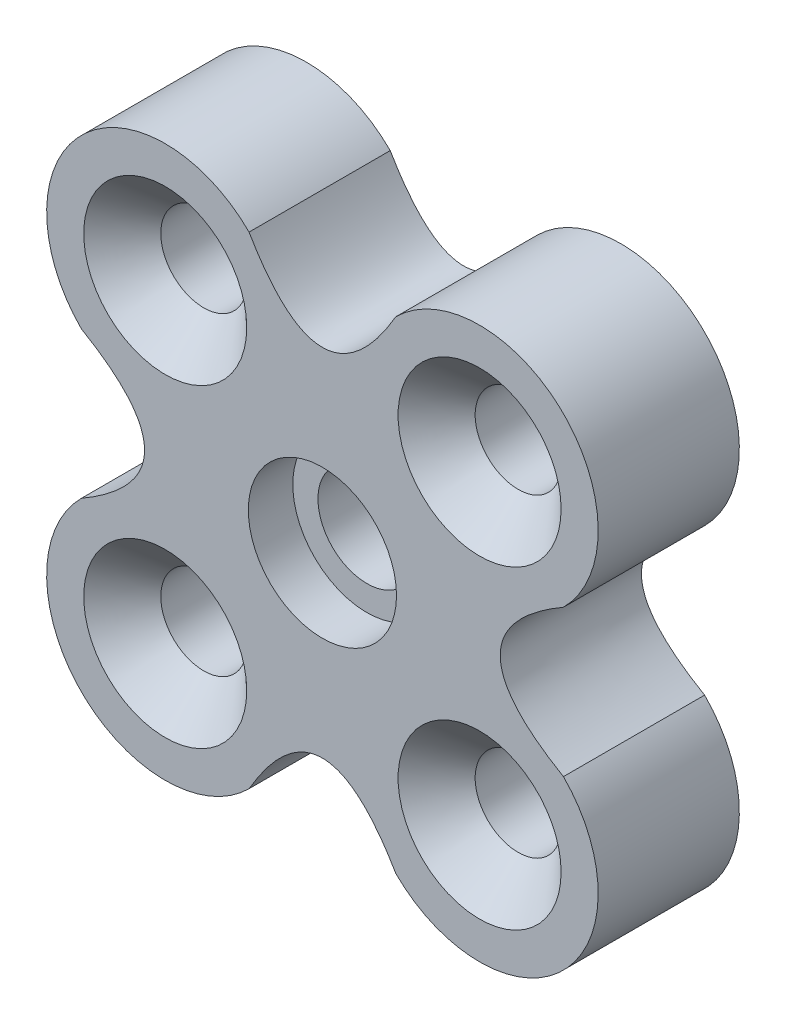
ISO-10303-21;
HEADER;
FILE_DESCRIPTION(('STEP AP214'),'2;1');
FILE_NAME('part.step','',(''),(''),'','','');
FILE_SCHEMA(('AUTOMOTIVE_DESIGN { 1 0 10303 214 1 1 1 1 }'));
ENDSEC;
DATA;
#1=APPLICATION_CONTEXT('core data for automotive mechanical design processes');
#2=APPLICATION_PROTOCOL_DEFINITION('international standard','automotive_design',2000,#1);
#3=PRODUCT_CONTEXT('',#1,'mechanical');
#4=PRODUCT('Part','Part','',(#3));
#5=PRODUCT_RELATED_PRODUCT_CATEGORY('part','',(#4));
#6=PRODUCT_DEFINITION_FORMATION('','',#4);
#7=PRODUCT_DEFINITION_CONTEXT('part definition',#1,'design');
#8=PRODUCT_DEFINITION('design','',#6,#7);
#9=PRODUCT_DEFINITION_SHAPE('','',#8);
#10=(LENGTH_UNIT() NAMED_UNIT(*) SI_UNIT(.MILLI.,.METRE.));
#11=(NAMED_UNIT(*) PLANE_ANGLE_UNIT() SI_UNIT($,.RADIAN.));
#12=(NAMED_UNIT(*) SI_UNIT($,.STERADIAN.) SOLID_ANGLE_UNIT());
#13=UNCERTAINTY_MEASURE_WITH_UNIT(LENGTH_MEASURE(1.E-05),#10,'distance_accuracy_value','');
#14=(GEOMETRIC_REPRESENTATION_CONTEXT(3) GLOBAL_UNCERTAINTY_ASSIGNED_CONTEXT((#13)) GLOBAL_UNIT_ASSIGNED_CONTEXT((#10,
#11,#12)) REPRESENTATION_CONTEXT('',''));
#15=CARTESIAN_POINT('',(0.,0.,0.));
#16=DIRECTION('',(0.,0.,1.));
#17=DIRECTION('',(1.,0.,0.));
#18=AXIS2_PLACEMENT_3D('',#15,#16,#17);
#19=CARTESIAN_POINT('',(0.,0.,4.763));
#20=DIRECTION('',(0.,0.,1.));
#21=DIRECTION('',(1.,0.,0.));
#22=AXIS2_PLACEMENT_3D('',#19,#20,#21);
#23=CYLINDRICAL_SURFACE('',#22,1.64999999999999);
#24=CARTESIAN_POINT('',(0.,0.,0.));
#25=DIRECTION('',(0.,0.,1.));
#26=DIRECTION('',(1.,0.,0.));
#27=AXIS2_PLACEMENT_3D('',#24,#25,#26);
#28=CIRCLE('',#27,1.65);
#29=CARTESIAN_POINT('',(1.65,0.,0.));
#30=VERTEX_POINT('',#29);
#31=EDGE_CURVE('E236',#30,#30,#28,.T.);
#32=ORIENTED_EDGE('',*,*,#31,.F.);
#33=EDGE_LOOP('',(#32));
#34=FACE_BOUND('',#33,.T.);
#35=CARTESIAN_POINT('',(0.,0.,3.263));
#36=DIRECTION('',(0.,0.,1.));
#37=DIRECTION('',(1.,0.,0.));
#38=AXIS2_PLACEMENT_3D('',#35,#36,#37);
#39=CIRCLE('',#38,1.64999999999999);
#40=CARTESIAN_POINT('',(1.64999999999999,0.,3.263));
#41=VERTEX_POINT('',#40);
#42=EDGE_CURVE('E43',#41,#41,#39,.F.);
#43=ORIENTED_EDGE('',*,*,#42,.F.);
#44=EDGE_LOOP('',(#43));
#45=FACE_BOUND('',#44,.T.);
#46=ADVANCED_FACE('F38',(#34,#45),#23,.F.);
#47=CARTESIAN_POINT('',(-8.13172798364529,2.47487373415292,4.763));
#48=CARTESIAN_POINT('',(-3.8682720163547,0.,4.763));
#49=CARTESIAN_POINT('',(-8.13172798364529,-2.47487373415292,4.763));
#50=B_SPLINE_CURVE_WITH_KNOTS('',2,(#47,#48,#49),.UNSPECIFIED.,.F.,.F.,(3,3),(0.,1.),.UNSPECIFIED.);
#51=DIRECTION('',(0.,0.,-1.));
#52=VECTOR('',#51,1.);
#53=SURFACE_OF_LINEAR_EXTRUSION('',#50,#52);
#54=CARTESIAN_POINT('',(-8.13172798364529,2.47487373415292,0.));
#55=CARTESIAN_POINT('',(-3.8682720163547,0.,0.));
#56=CARTESIAN_POINT('',(-8.13172798364529,-2.47487373415292,0.));
#57=B_SPLINE_CURVE_WITH_KNOTS('',2,(#54,#55,#56),.UNSPECIFIED.,.F.,.F.,(3,3),(0.,1.),.UNSPECIFIED.);
#58=CARTESIAN_POINT('',(-8.13172798364529,2.47487373415291,0.));
#59=VERTEX_POINT('',#58);
#60=CARTESIAN_POINT('',(-8.13172798364529,-2.47487373415292,0.));
#61=VERTEX_POINT('',#60);
#62=EDGE_CURVE('E255',#59,#61,#57,.T.);
#63=ORIENTED_EDGE('',*,*,#62,.T.);
#64=DIRECTION('',(0.,0.,-1.));
#65=VECTOR('',#64,1.);
#66=CARTESIAN_POINT('',(-8.13172798364529,-2.47487373415292,4.763));
#67=LINE('',#66,#65);
#68=CARTESIAN_POINT('',(-8.13172798364529,-2.47487373415292,4.763));
#69=VERTEX_POINT('',#68);
#70=EDGE_CURVE('E12',#69,#61,#67,.T.);
#71=ORIENTED_EDGE('',*,*,#70,.F.);
#72=CARTESIAN_POINT('',(-8.13172798364529,2.47487373415291,4.763));
#73=VERTEX_POINT('',#72);
#74=EDGE_CURVE('E312',#73,#69,#50,.T.);
#75=ORIENTED_EDGE('',*,*,#74,.F.);
#76=DIRECTION('',(0.,0.,-1.));
#77=VECTOR('',#76,1.);
#78=CARTESIAN_POINT('',(-8.13172798364529,2.47487373415291,4.763));
#79=LINE('',#78,#77);
#80=EDGE_CURVE('E133',#73,#59,#79,.T.);
#81=ORIENTED_EDGE('',*,*,#80,.T.);
#82=EDGE_LOOP('',(#63,#71,#75,#81));
#83=FACE_BOUND('',#82,.T.);
#84=ADVANCED_FACE('F40',(#83),#53,.F.);
#85=CARTESIAN_POINT('',(-5.30330085889911,-5.30330085889923,4.763));
#86=DIRECTION('',(0.,0.,-1.));
#87=DIRECTION('',(-1.,0.,0.));
#88=AXIS2_PLACEMENT_3D('',#85,#86,#87);
#89=CYLINDRICAL_SURFACE('',#88,4.00000000000009);
#90=CARTESIAN_POINT('',(-5.30330085889911,-5.30330085889923,0.));
#91=DIRECTION('',(0.,0.,1.));
#92=DIRECTION('',(1.,0.,0.));
#93=AXIS2_PLACEMENT_3D('',#90,#91,#92);
#94=CIRCLE('',#93,4.00000000000009);
#95=CARTESIAN_POINT('',(-2.47487373415292,-8.13172798364555,0.));
#96=VERTEX_POINT('',#95);
#97=EDGE_CURVE('E257',#61,#96,#94,.T.);
#98=ORIENTED_EDGE('',*,*,#97,.T.);
#99=DIRECTION('',(0.,0.,-1.));
#100=VECTOR('',#99,1.);
#101=CARTESIAN_POINT('',(-2.47487373415292,-8.13172798364555,4.763));
#102=LINE('',#101,#100);
#103=CARTESIAN_POINT('',(-2.47487373415292,-8.13172798364555,4.763));
#104=VERTEX_POINT('',#103);
#105=EDGE_CURVE('E49',#104,#96,#102,.T.);
#106=ORIENTED_EDGE('',*,*,#105,.F.);
#107=CARTESIAN_POINT('',(-5.30330085889911,-5.30330085889923,4.763));
#108=DIRECTION('',(0.,0.,1.));
#109=DIRECTION('',(1.,0.,0.));
#110=AXIS2_PLACEMENT_3D('',#107,#108,#109);
#111=CIRCLE('',#110,4.00000000000009);
#112=EDGE_CURVE('E100',#69,#104,#111,.T.);
#113=ORIENTED_EDGE('',*,*,#112,.F.);
#114=ORIENTED_EDGE('',*,*,#70,.T.);
#115=EDGE_LOOP('',(#98,#106,#113,#114));
#116=FACE_BOUND('',#115,.T.);
#117=ADVANCED_FACE('F176',(#116),#89,.T.);
#118=CARTESIAN_POINT('',(-2.47487373415292,-8.13172798364555,4.763));
#119=CARTESIAN_POINT('',(-1.49929913861695E-13,-3.8682720163546,4.763));
#120=CARTESIAN_POINT('',(2.47487373415288,-8.13172798364525,4.763));
#121=B_SPLINE_CURVE_WITH_KNOTS('',2,(#118,#119,#120),.UNSPECIFIED.,.F.,.F.,(3,3),(0.,1.),.UNSPECIFIED.);
#122=DIRECTION('',(0.,0.,-1.));
#123=VECTOR('',#122,1.);
#124=SURFACE_OF_LINEAR_EXTRUSION('',#121,#123);
#125=CARTESIAN_POINT('',(-2.47487373415292,-8.13172798364555,0.));
#126=CARTESIAN_POINT('',(-1.49929913861695E-13,-3.8682720163546,0.));
#127=CARTESIAN_POINT('',(2.47487373415288,-8.13172798364525,0.));
#128=B_SPLINE_CURVE_WITH_KNOTS('',2,(#125,#126,#127),.UNSPECIFIED.,.F.,.F.,(3,3),(0.,1.),.UNSPECIFIED.);
#129=CARTESIAN_POINT('',(2.47487373415288,-8.13172798364525,0.));
#130=VERTEX_POINT('',#129);
#131=EDGE_CURVE('E259',#96,#130,#128,.T.);
#132=ORIENTED_EDGE('',*,*,#131,.T.);
#133=DIRECTION('',(0.,0.,-1.));
#134=VECTOR('',#133,1.);
#135=CARTESIAN_POINT('',(2.47487373415288,-8.13172798364525,4.763));
#136=LINE('',#135,#134);
#137=CARTESIAN_POINT('',(2.47487373415288,-8.13172798364525,4.763));
#138=VERTEX_POINT('',#137);
#139=EDGE_CURVE('E319',#138,#130,#136,.T.);
#140=ORIENTED_EDGE('',*,*,#139,.F.);
#141=EDGE_CURVE('E166',#104,#138,#121,.T.);
#142=ORIENTED_EDGE('',*,*,#141,.F.);
#143=ORIENTED_EDGE('',*,*,#105,.T.);
#144=EDGE_LOOP('',(#132,#140,#142,#143));
#145=FACE_BOUND('',#144,.T.);
#146=ADVANCED_FACE('F174',(#145),#124,.F.);
#147=CARTESIAN_POINT('',(5.30330085889909,-5.30330085889898,4.763));
#148=DIRECTION('',(0.,0.,-1.));
#149=DIRECTION('',(-1.,0.,0.));
#150=AXIS2_PLACEMENT_3D('',#147,#148,#149);
#151=CYLINDRICAL_SURFACE('',#150,4.00000000000006);
#152=CARTESIAN_POINT('',(5.30330085889909,-5.30330085889898,0.));
#153=DIRECTION('',(0.,0.,1.));
#154=DIRECTION('',(-1.,0.,0.));
#155=AXIS2_PLACEMENT_3D('',#152,#153,#154);
#156=CIRCLE('',#155,4.00000000000006);
#157=CARTESIAN_POINT('',(8.13172798364529,-2.47487373415272,0.));
#158=VERTEX_POINT('',#157);
#159=EDGE_CURVE('E283',#130,#158,#156,.T.);
#160=ORIENTED_EDGE('',*,*,#159,.T.);
#161=DIRECTION('',(0.,0.,-1.));
#162=VECTOR('',#161,1.);
#163=CARTESIAN_POINT('',(8.13172798364529,-2.47487373415272,4.763));
#164=LINE('',#163,#162);
#165=CARTESIAN_POINT('',(8.13172798364529,-2.47487373415272,4.763));
#166=VERTEX_POINT('',#165);
#167=EDGE_CURVE('E316',#166,#158,#164,.T.);
#168=ORIENTED_EDGE('',*,*,#167,.F.);
#169=CARTESIAN_POINT('',(5.30330085889909,-5.30330085889898,4.763));
#170=DIRECTION('',(0.,0.,1.));
#171=DIRECTION('',(-1.,0.,0.));
#172=AXIS2_PLACEMENT_3D('',#169,#170,#171);
#173=CIRCLE('',#172,4.00000000000006);
#174=EDGE_CURVE('E161',#138,#166,#173,.T.);
#175=ORIENTED_EDGE('',*,*,#174,.F.);
#176=ORIENTED_EDGE('',*,*,#139,.T.);
#177=EDGE_LOOP('',(#160,#168,#175,#176));
#178=FACE_BOUND('',#177,.T.);
#179=ADVANCED_FACE('F154',(#178),#151,.T.);
#180=CARTESIAN_POINT('',(8.13172798364529,-2.47487373415272,4.763));
#181=CARTESIAN_POINT('',(3.86827201635471,0.,4.763));
#182=CARTESIAN_POINT('',(8.13172798364529,2.47487373415292,4.763));
#183=B_SPLINE_CURVE_WITH_KNOTS('',2,(#180,#181,#182),.UNSPECIFIED.,.F.,.F.,(3,3),(0.,1.),.UNSPECIFIED.);
#184=DIRECTION('',(0.,0.,-1.));
#185=VECTOR('',#184,1.);
#186=SURFACE_OF_LINEAR_EXTRUSION('',#183,#185);
#187=CARTESIAN_POINT('',(8.13172798364529,-2.47487373415272,0.));
#188=CARTESIAN_POINT('',(3.86827201635471,0.,0.));
#189=CARTESIAN_POINT('',(8.13172798364529,2.47487373415292,0.));
#190=B_SPLINE_CURVE_WITH_KNOTS('',2,(#187,#188,#189),.UNSPECIFIED.,.F.,.F.,(3,3),(0.,1.),.UNSPECIFIED.);
#191=CARTESIAN_POINT('',(8.13172798364529,2.47487373415292,0.));
#192=VERTEX_POINT('',#191);
#193=EDGE_CURVE('E289',#158,#192,#190,.T.);
#194=ORIENTED_EDGE('',*,*,#193,.T.);
#195=DIRECTION('',(0.,0.,-1.));
#196=VECTOR('',#195,1.);
#197=CARTESIAN_POINT('',(8.13172798364529,2.47487373415292,4.763));
#198=LINE('',#197,#196);
#199=CARTESIAN_POINT('',(8.13172798364529,2.47487373415292,4.763));
#200=VERTEX_POINT('',#199);
#201=EDGE_CURVE('E128',#200,#192,#198,.T.);
#202=ORIENTED_EDGE('',*,*,#201,.F.);
#203=EDGE_CURVE('E119',#166,#200,#183,.T.);
#204=ORIENTED_EDGE('',*,*,#203,.F.);
#205=ORIENTED_EDGE('',*,*,#167,.T.);
#206=EDGE_LOOP('',(#194,#202,#204,#205));
#207=FACE_BOUND('',#206,.T.);
#208=ADVANCED_FACE('F151',(#207),#186,.F.);
#209=CARTESIAN_POINT('',(5.30330085889909,5.30330085889911,4.763));
#210=DIRECTION('',(0.,0.,-1.));
#211=DIRECTION('',(-1.,0.,0.));
#212=AXIS2_PLACEMENT_3D('',#209,#210,#211);
#213=CYLINDRICAL_SURFACE('',#212,4.00000000000001);
#214=CARTESIAN_POINT('',(5.30330085889909,5.30330085889911,0.));
#215=DIRECTION('',(0.,0.,1.));
#216=DIRECTION('',(-1.,0.,0.));
#217=AXIS2_PLACEMENT_3D('',#214,#215,#216);
#218=CIRCLE('',#217,4.00000000000001);
#219=CARTESIAN_POINT('',(2.47487373415288,8.1317279836453,0.));
#220=VERTEX_POINT('',#219);
#221=EDGE_CURVE('E127',#192,#220,#218,.T.);
#222=ORIENTED_EDGE('',*,*,#221,.T.);
#223=DIRECTION('',(0.,0.,-1.));
#224=VECTOR('',#223,1.);
#225=CARTESIAN_POINT('',(2.47487373415288,8.1317279836453,4.763));
#226=LINE('',#225,#224);
#227=CARTESIAN_POINT('',(2.47487373415288,8.1317279836453,4.763));
#228=VERTEX_POINT('',#227);
#229=EDGE_CURVE('E124',#228,#220,#226,.T.);
#230=ORIENTED_EDGE('',*,*,#229,.F.);
#231=CARTESIAN_POINT('',(5.30330085889909,5.30330085889911,4.763));
#232=DIRECTION('',(0.,0.,1.));
#233=DIRECTION('',(-1.,0.,0.));
#234=AXIS2_PLACEMENT_3D('',#231,#232,#233);
#235=CIRCLE('',#234,4.00000000000001);
#236=EDGE_CURVE('E113',#200,#228,#235,.T.);
#237=ORIENTED_EDGE('',*,*,#236,.F.);
#238=ORIENTED_EDGE('',*,*,#201,.T.);
#239=EDGE_LOOP('',(#222,#230,#237,#238));
#240=FACE_BOUND('',#239,.T.);
#241=ADVANCED_FACE('F125',(#240),#213,.T.);
#242=CARTESIAN_POINT('',(2.47487373415288,8.1317279836453,4.763));
#243=CARTESIAN_POINT('',(0.,3.8682720163547,4.763));
#244=CARTESIAN_POINT('',(-2.47487373415292,8.1317279836453,4.763));
#245=B_SPLINE_CURVE_WITH_KNOTS('',2,(#242,#243,#244),.UNSPECIFIED.,.F.,.F.,(3,3),(0.,1.),.UNSPECIFIED.);
#246=DIRECTION('',(0.,0.,-1.));
#247=VECTOR('',#246,1.);
#248=SURFACE_OF_LINEAR_EXTRUSION('',#245,#247);
#249=CARTESIAN_POINT('',(2.47487373415288,8.1317279836453,0.));
#250=CARTESIAN_POINT('',(0.,3.8682720163547,0.));
#251=CARTESIAN_POINT('',(-2.47487373415292,8.1317279836453,0.));
#252=B_SPLINE_CURVE_WITH_KNOTS('',2,(#249,#250,#251),.UNSPECIFIED.,.F.,.F.,(3,3),(0.,1.),.UNSPECIFIED.);
#253=CARTESIAN_POINT('',(-2.47487373415292,8.1317279836453,0.));
#254=VERTEX_POINT('',#253);
#255=EDGE_CURVE('E86',#220,#254,#252,.T.);
#256=ORIENTED_EDGE('',*,*,#255,.T.);
#257=DIRECTION('',(0.,0.,-1.));
#258=VECTOR('',#257,1.);
#259=CARTESIAN_POINT('',(-2.47487373415292,8.1317279836453,4.763));
#260=LINE('',#259,#258);
#261=CARTESIAN_POINT('',(-2.47487373415292,8.1317279836453,4.763));
#262=VERTEX_POINT('',#261);
#263=EDGE_CURVE('E129',#262,#254,#260,.T.);
#264=ORIENTED_EDGE('',*,*,#263,.F.);
#265=EDGE_CURVE('E117',#228,#262,#245,.T.);
#266=ORIENTED_EDGE('',*,*,#265,.F.);
#267=ORIENTED_EDGE('',*,*,#229,.T.);
#268=EDGE_LOOP('',(#256,#264,#266,#267));
#269=FACE_BOUND('',#268,.T.);
#270=ADVANCED_FACE('F131',(#269),#248,.F.);
#271=CARTESIAN_POINT('',(-5.30330085889911,5.30330085889911,4.763));
#272=DIRECTION('',(0.,0.,-1.));
#273=DIRECTION('',(-1.,0.,0.));
#274=AXIS2_PLACEMENT_3D('',#271,#272,#273);
#275=CYLINDRICAL_SURFACE('',#274,4.);
#276=CARTESIAN_POINT('',(-5.30330085889911,5.30330085889911,0.));
#277=DIRECTION('',(0.,0.,1.));
#278=DIRECTION('',(-1.,0.,0.));
#279=AXIS2_PLACEMENT_3D('',#276,#277,#278);
#280=CIRCLE('',#279,4.);
#281=EDGE_CURVE('E92',#254,#59,#280,.T.);
#282=ORIENTED_EDGE('',*,*,#281,.T.);
#283=ORIENTED_EDGE('',*,*,#80,.F.);
#284=CARTESIAN_POINT('',(-5.30330085889911,5.30330085889911,4.763));
#285=DIRECTION('',(0.,0.,1.));
#286=DIRECTION('',(-1.,0.,0.));
#287=AXIS2_PLACEMENT_3D('',#284,#285,#286);
#288=CIRCLE('',#287,4.);
#289=EDGE_CURVE('E57',#262,#73,#288,.T.);
#290=ORIENTED_EDGE('',*,*,#289,.F.);
#291=ORIENTED_EDGE('',*,*,#263,.T.);
#292=EDGE_LOOP('',(#282,#283,#290,#291));
#293=FACE_BOUND('',#292,.T.);
#294=ADVANCED_FACE('F147',(#293),#275,.T.);
#295=CARTESIAN_POINT('',(-6.,0.,4.763));
#296=DIRECTION('',(0.,0.,-1.));
#297=DIRECTION('',(-1.,0.,0.));
#298=AXIS2_PLACEMENT_3D('',#295,#296,#297);
#299=PLANE('',#298);
#300=CARTESIAN_POINT('',(0.,0.,4.763));
#301=DIRECTION('',(0.,0.,1.));
#302=DIRECTION('',(1.,0.,0.));
#303=AXIS2_PLACEMENT_3D('',#300,#301,#302);
#304=CIRCLE('',#303,2.5);
#305=CARTESIAN_POINT('',(2.5,0.,4.763));
#306=VERTEX_POINT('',#305);
#307=EDGE_CURVE('E743',#306,#306,#304,.T.);
#308=ORIENTED_EDGE('',*,*,#307,.F.);
#309=EDGE_LOOP('',(#308));
#310=FACE_BOUND('',#309,.T.);
#311=CARTESIAN_POINT('',(-5.30330085889911,5.30330085889911,4.763));
#312=DIRECTION('',(0.,0.,1.));
#313=DIRECTION('',(1.,0.,0.));
#314=AXIS2_PLACEMENT_3D('',#311,#312,#313);
#315=CIRCLE('',#314,2.75);
#316=CARTESIAN_POINT('',(-2.55330085889911,5.30330085889911,4.763));
#317=VERTEX_POINT('',#316);
#318=EDGE_CURVE('E739',#317,#317,#315,.T.);
#319=ORIENTED_EDGE('',*,*,#318,.F.);
#320=EDGE_LOOP('',(#319));
#321=FACE_BOUND('',#320,.T.);
#322=CARTESIAN_POINT('',(5.30330085889911,5.30330085889911,4.763));
#323=DIRECTION('',(0.,0.,1.));
#324=DIRECTION('',(1.,0.,0.));
#325=AXIS2_PLACEMENT_3D('',#322,#323,#324);
#326=CIRCLE('',#325,2.75);
#327=CARTESIAN_POINT('',(8.0533008588991,5.30330085889911,4.763));
#328=VERTEX_POINT('',#327);
#329=EDGE_CURVE('E731',#328,#328,#326,.T.);
#330=ORIENTED_EDGE('',*,*,#329,.F.);
#331=EDGE_LOOP('',(#330));
#332=FACE_BOUND('',#331,.T.);
#333=CARTESIAN_POINT('',(5.30330085889911,-5.30330085889911,4.763));
#334=DIRECTION('',(0.,0.,1.));
#335=DIRECTION('',(1.,0.,0.));
#336=AXIS2_PLACEMENT_3D('',#333,#334,#335);
#337=CIRCLE('',#336,2.75);
#338=CARTESIAN_POINT('',(8.0533008588991,-5.30330085889911,4.763));
#339=VERTEX_POINT('',#338);
#340=EDGE_CURVE('E724',#339,#339,#337,.T.);
#341=ORIENTED_EDGE('',*,*,#340,.F.);
#342=EDGE_LOOP('',(#341));
#343=FACE_BOUND('',#342,.T.);
#344=CARTESIAN_POINT('',(-5.30330085889911,-5.30330085889911,4.763));
#345=DIRECTION('',(0.,0.,1.));
#346=DIRECTION('',(1.,0.,0.));
#347=AXIS2_PLACEMENT_3D('',#344,#345,#346);
#348=CIRCLE('',#347,2.75);
#349=CARTESIAN_POINT('',(-2.55330085889911,-5.30330085889911,4.763));
#350=VERTEX_POINT('',#349);
#351=EDGE_CURVE('E713',#350,#350,#348,.T.);
#352=ORIENTED_EDGE('',*,*,#351,.F.);
#353=EDGE_LOOP('',(#352));
#354=FACE_BOUND('',#353,.T.);
#355=ORIENTED_EDGE('',*,*,#74,.T.);
#356=ORIENTED_EDGE('',*,*,#112,.T.);
#357=ORIENTED_EDGE('',*,*,#141,.T.);
#358=ORIENTED_EDGE('',*,*,#174,.T.);
#359=ORIENTED_EDGE('',*,*,#203,.T.);
#360=ORIENTED_EDGE('',*,*,#236,.T.);
#361=ORIENTED_EDGE('',*,*,#265,.T.);
#362=ORIENTED_EDGE('',*,*,#289,.T.);
#363=EDGE_LOOP('',(#355,#356,#357,#358,#359,#360,#361,#362));
#364=FACE_BOUND('',#363,.T.);
#365=ADVANCED_FACE('F115',(#310,#321,#332,#343,#354,#364),#299,.F.);
#366=CARTESIAN_POINT('',(-6.,0.,0.));
#367=DIRECTION('',(0.,0.,-1.));
#368=DIRECTION('',(-1.,0.,0.));
#369=AXIS2_PLACEMENT_3D('',#366,#367,#368);
#370=PLANE('',#369);
#371=ORIENTED_EDGE('',*,*,#31,.T.);
#372=EDGE_LOOP('',(#371));
#373=FACE_BOUND('',#372,.T.);
#374=CARTESIAN_POINT('',(-5.30330085889911,5.30330085889911,0.));
#375=DIRECTION('',(0.,0.,1.));
#376=DIRECTION('',(1.,0.,0.));
#377=AXIS2_PLACEMENT_3D('',#374,#375,#376);
#378=CIRCLE('',#377,1.45);
#379=CARTESIAN_POINT('',(-3.85330085889911,5.30330085889911,0.));
#380=VERTEX_POINT('',#379);
#381=EDGE_CURVE('E240',#380,#380,#378,.T.);
#382=ORIENTED_EDGE('',*,*,#381,.T.);
#383=EDGE_LOOP('',(#382));
#384=FACE_BOUND('',#383,.T.);
#385=CARTESIAN_POINT('',(5.30330085889911,5.30330085889911,0.));
#386=DIRECTION('',(0.,0.,1.));
#387=DIRECTION('',(1.,0.,0.));
#388=AXIS2_PLACEMENT_3D('',#385,#386,#387);
#389=CIRCLE('',#388,1.45);
#390=CARTESIAN_POINT('',(6.7533008588991,5.30330085889911,0.));
#391=VERTEX_POINT('',#390);
#392=EDGE_CURVE('E244',#391,#391,#389,.T.);
#393=ORIENTED_EDGE('',*,*,#392,.T.);
#394=EDGE_LOOP('',(#393));
#395=FACE_BOUND('',#394,.T.);
#396=CARTESIAN_POINT('',(5.30330085889911,-5.30330085889911,0.));
#397=DIRECTION('',(0.,0.,1.));
#398=DIRECTION('',(1.,0.,0.));
#399=AXIS2_PLACEMENT_3D('',#396,#397,#398);
#400=CIRCLE('',#399,1.45);
#401=CARTESIAN_POINT('',(6.7533008588991,-5.30330085889911,0.));
#402=VERTEX_POINT('',#401);
#403=EDGE_CURVE('E248',#402,#402,#400,.T.);
#404=ORIENTED_EDGE('',*,*,#403,.T.);
#405=EDGE_LOOP('',(#404));
#406=FACE_BOUND('',#405,.T.);
#407=CARTESIAN_POINT('',(-5.30330085889911,-5.30330085889911,0.));
#408=DIRECTION('',(0.,0.,1.));
#409=DIRECTION('',(1.,0.,0.));
#410=AXIS2_PLACEMENT_3D('',#407,#408,#409);
#411=CIRCLE('',#410,1.45);
#412=CARTESIAN_POINT('',(-3.85330085889911,-5.30330085889911,0.));
#413=VERTEX_POINT('',#412);
#414=EDGE_CURVE('E252',#413,#413,#411,.T.);
#415=ORIENTED_EDGE('',*,*,#414,.T.);
#416=EDGE_LOOP('',(#415));
#417=FACE_BOUND('',#416,.T.);
#418=ORIENTED_EDGE('',*,*,#62,.F.);
#419=ORIENTED_EDGE('',*,*,#281,.F.);
#420=ORIENTED_EDGE('',*,*,#255,.F.);
#421=ORIENTED_EDGE('',*,*,#221,.F.);
#422=ORIENTED_EDGE('',*,*,#193,.F.);
#423=ORIENTED_EDGE('',*,*,#159,.F.);
#424=ORIENTED_EDGE('',*,*,#131,.F.);
#425=ORIENTED_EDGE('',*,*,#97,.F.);
#426=EDGE_LOOP('',(#418,#419,#420,#421,#422,#423,#424,#425));
#427=FACE_BOUND('',#426,.T.);
#428=ADVANCED_FACE('F226',(#373,#384,#395,#406,#417,#427),#370,.T.);
#429=CARTESIAN_POINT('',(-5.30330085889911,-5.30330085889911,4.763));
#430=DIRECTION('',(0.,0.,1.));
#431=DIRECTION('',(1.,0.,0.));
#432=AXIS2_PLACEMENT_3D('',#429,#430,#431);
#433=CYLINDRICAL_SURFACE('',#432,1.45);
#434=ORIENTED_EDGE('',*,*,#414,.F.);
#435=EDGE_LOOP('',(#434));
#436=FACE_BOUND('',#435,.T.);
#437=CARTESIAN_POINT('',(-5.30330085889911,-5.30330085889911,3.463));
#438=DIRECTION('',(0.,0.,1.));
#439=DIRECTION('',(1.,0.,0.));
#440=AXIS2_PLACEMENT_3D('',#437,#438,#439);
#441=CIRCLE('',#440,1.45);
#442=CARTESIAN_POINT('',(-3.85330085889911,-5.30330085889911,3.463));
#443=VERTEX_POINT('',#442);
#444=EDGE_CURVE('E261',#443,#443,#441,.T.);
#445=ORIENTED_EDGE('',*,*,#444,.T.);
#446=EDGE_LOOP('',(#445));
#447=FACE_BOUND('',#446,.T.);
#448=ADVANCED_FACE('F222',(#436,#447),#433,.F.);
#449=CARTESIAN_POINT('',(-5.30330085889911,-5.30330085889911,4.763));
#450=DIRECTION('',(0.,0.,1.));
#451=DIRECTION('',(1.,0.,0.));
#452=AXIS2_PLACEMENT_3D('',#449,#450,#451);
#453=CONICAL_SURFACE('',#452,2.75,0.785398163397448);
#454=ORIENTED_EDGE('',*,*,#444,.F.);
#455=EDGE_LOOP('',(#454));
#456=FACE_BOUND('',#455,.T.);
#457=ORIENTED_EDGE('',*,*,#351,.T.);
#458=EDGE_LOOP('',(#457));
#459=FACE_BOUND('',#458,.T.);
#460=ADVANCED_FACE('F218',(#456,#459),#453,.F.);
#461=CARTESIAN_POINT('',(5.30330085889911,-5.30330085889911,4.763));
#462=DIRECTION('',(0.,0.,1.));
#463=DIRECTION('',(1.,0.,0.));
#464=AXIS2_PLACEMENT_3D('',#461,#462,#463);
#465=CYLINDRICAL_SURFACE('',#464,1.45);
#466=ORIENTED_EDGE('',*,*,#403,.F.);
#467=EDGE_LOOP('',(#466));
#468=FACE_BOUND('',#467,.T.);
#469=CARTESIAN_POINT('',(5.30330085889911,-5.30330085889911,3.463));
#470=DIRECTION('',(0.,0.,1.));
#471=DIRECTION('',(1.,0.,0.));
#472=AXIS2_PLACEMENT_3D('',#469,#470,#471);
#473=CIRCLE('',#472,1.45);
#474=CARTESIAN_POINT('',(6.7533008588991,-5.30330085889911,3.463));
#475=VERTEX_POINT('',#474);
#476=EDGE_CURVE('E714',#475,#475,#473,.T.);
#477=ORIENTED_EDGE('',*,*,#476,.T.);
#478=EDGE_LOOP('',(#477));
#479=FACE_BOUND('',#478,.T.);
#480=ADVANCED_FACE('F214',(#468,#479),#465,.F.);
#481=CARTESIAN_POINT('',(5.30330085889911,-5.30330085889911,4.763));
#482=DIRECTION('',(0.,0.,1.));
#483=DIRECTION('',(1.,0.,0.));
#484=AXIS2_PLACEMENT_3D('',#481,#482,#483);
#485=CONICAL_SURFACE('',#484,2.75,0.785398163397447);
#486=ORIENTED_EDGE('',*,*,#476,.F.);
#487=EDGE_LOOP('',(#486));
#488=FACE_BOUND('',#487,.T.);
#489=ORIENTED_EDGE('',*,*,#340,.T.);
#490=EDGE_LOOP('',(#489));
#491=FACE_BOUND('',#490,.T.);
#492=ADVANCED_FACE('F210',(#488,#491),#485,.F.);
#493=CARTESIAN_POINT('',(5.30330085889911,5.30330085889911,4.763));
#494=DIRECTION('',(0.,0.,1.));
#495=DIRECTION('',(1.,0.,0.));
#496=AXIS2_PLACEMENT_3D('',#493,#494,#495);
#497=CYLINDRICAL_SURFACE('',#496,1.45);
#498=ORIENTED_EDGE('',*,*,#392,.F.);
#499=EDGE_LOOP('',(#498));
#500=FACE_BOUND('',#499,.T.);
#501=CARTESIAN_POINT('',(5.30330085889911,5.30330085889911,3.463));
#502=DIRECTION('',(0.,0.,1.));
#503=DIRECTION('',(1.,0.,0.));
#504=AXIS2_PLACEMENT_3D('',#501,#502,#503);
#505=CIRCLE('',#504,1.45);
#506=CARTESIAN_POINT('',(6.7533008588991,5.30330085889911,3.463));
#507=VERTEX_POINT('',#506);
#508=EDGE_CURVE('E728',#507,#507,#505,.T.);
#509=ORIENTED_EDGE('',*,*,#508,.T.);
#510=EDGE_LOOP('',(#509));
#511=FACE_BOUND('',#510,.T.);
#512=ADVANCED_FACE('F206',(#500,#511),#497,.F.);
#513=CARTESIAN_POINT('',(5.30330085889911,5.30330085889911,4.763));
#514=DIRECTION('',(0.,0.,1.));
#515=DIRECTION('',(1.,0.,0.));
#516=AXIS2_PLACEMENT_3D('',#513,#514,#515);
#517=CONICAL_SURFACE('',#516,2.75,0.785398163397447);
#518=ORIENTED_EDGE('',*,*,#508,.F.);
#519=EDGE_LOOP('',(#518));
#520=FACE_BOUND('',#519,.T.);
#521=ORIENTED_EDGE('',*,*,#329,.T.);
#522=EDGE_LOOP('',(#521));
#523=FACE_BOUND('',#522,.T.);
#524=ADVANCED_FACE('F202',(#520,#523),#517,.F.);
#525=CARTESIAN_POINT('',(-5.30330085889911,5.30330085889911,4.763));
#526=DIRECTION('',(0.,0.,1.));
#527=DIRECTION('',(1.,0.,0.));
#528=AXIS2_PLACEMENT_3D('',#525,#526,#527);
#529=CYLINDRICAL_SURFACE('',#528,1.45);
#530=ORIENTED_EDGE('',*,*,#381,.F.);
#531=EDGE_LOOP('',(#530));
#532=FACE_BOUND('',#531,.T.);
#533=CARTESIAN_POINT('',(-5.30330085889911,5.30330085889911,3.463));
#534=DIRECTION('',(0.,0.,1.));
#535=DIRECTION('',(1.,0.,0.));
#536=AXIS2_PLACEMENT_3D('',#533,#534,#535);
#537=CIRCLE('',#536,1.45);
#538=CARTESIAN_POINT('',(-3.85330085889911,5.30330085889911,3.463));
#539=VERTEX_POINT('',#538);
#540=EDGE_CURVE('E736',#539,#539,#537,.T.);
#541=ORIENTED_EDGE('',*,*,#540,.T.);
#542=EDGE_LOOP('',(#541));
#543=FACE_BOUND('',#542,.T.);
#544=ADVANCED_FACE('F198',(#532,#543),#529,.F.);
#545=CARTESIAN_POINT('',(-5.30330085889911,5.30330085889911,4.763));
#546=DIRECTION('',(0.,0.,1.));
#547=DIRECTION('',(1.,0.,0.));
#548=AXIS2_PLACEMENT_3D('',#545,#546,#547);
#549=CONICAL_SURFACE('',#548,2.75,0.785398163397448);
#550=ORIENTED_EDGE('',*,*,#540,.F.);
#551=EDGE_LOOP('',(#550));
#552=FACE_BOUND('',#551,.T.);
#553=ORIENTED_EDGE('',*,*,#318,.T.);
#554=EDGE_LOOP('',(#553));
#555=FACE_BOUND('',#554,.T.);
#556=ADVANCED_FACE('F194',(#552,#555),#549,.F.);
#557=CARTESIAN_POINT('',(0.,0.,3.263));
#558=DIRECTION('',(0.,0.,1.));
#559=DIRECTION('',(1.,0.,0.));
#560=AXIS2_PLACEMENT_3D('',#557,#558,#559);
#561=PLANE('',#560);
#562=CARTESIAN_POINT('',(0.,0.,3.263));
#563=DIRECTION('',(0.,0.,1.));
#564=DIRECTION('',(1.,0.,0.));
#565=AXIS2_PLACEMENT_3D('',#562,#563,#564);
#566=CIRCLE('',#565,2.5);
#567=CARTESIAN_POINT('',(2.5,0.,3.263));
#568=VERTEX_POINT('',#567);
#569=EDGE_CURVE('E746',#568,#568,#566,.T.);
#570=ORIENTED_EDGE('',*,*,#569,.T.);
#571=EDGE_LOOP('',(#570));
#572=FACE_BOUND('',#571,.T.);
#573=ORIENTED_EDGE('',*,*,#42,.T.);
#574=EDGE_LOOP('',(#573));
#575=FACE_BOUND('',#574,.T.);
#576=ADVANCED_FACE('F197',(#572,#575),#561,.T.);
#577=CARTESIAN_POINT('',(0.,0.,3.263));
#578=DIRECTION('',(0.,0.,1.));
#579=DIRECTION('',(1.,0.,0.));
#580=AXIS2_PLACEMENT_3D('',#577,#578,#579);
#581=CYLINDRICAL_SURFACE('',#580,2.5);
#582=ORIENTED_EDGE('',*,*,#569,.F.);
#583=EDGE_LOOP('',(#582));
#584=FACE_BOUND('',#583,.T.);
#585=ORIENTED_EDGE('',*,*,#307,.T.);
#586=EDGE_LOOP('',(#585));
#587=FACE_BOUND('',#586,.T.);
#588=ADVANCED_FACE('F192',(#584,#587),#581,.F.);
#589=CLOSED_SHELL('',(#46,#84,#117,#146,#179,#208,#241,#270,#294,#365,#428,#448,#460,#480,#492,
#512,#524,#544,#556,#576,#588));
#590=MANIFOLD_SOLID_BREP('B2',#589);
#591=ADVANCED_BREP_SHAPE_REPRESENTATION('',(#18,#590),#14);
#592=SHAPE_DEFINITION_REPRESENTATION(#9,#591);
ENDSEC;
END-ISO-10303-21;
